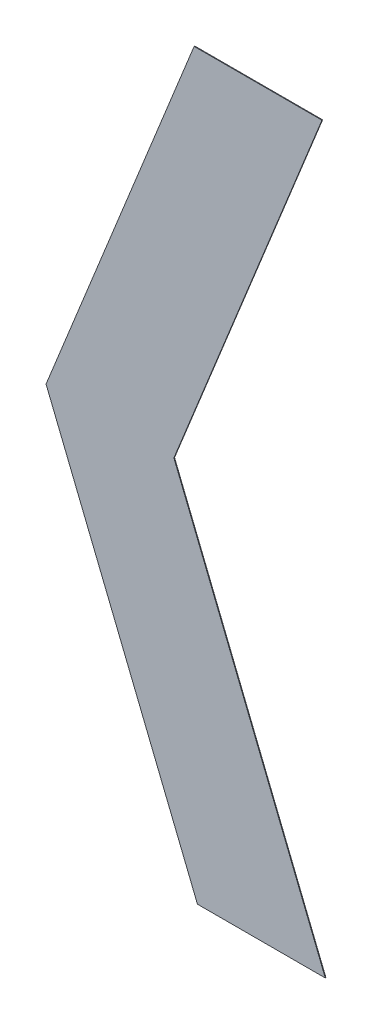
ISO-10303-21;
HEADER;
FILE_DESCRIPTION(('STEP AP214'),'2;1');
FILE_NAME('part.step','',(''),(''),'','','');
FILE_SCHEMA(('AUTOMOTIVE_DESIGN { 1 0 10303 214 1 1 1 1 }'));
ENDSEC;
DATA;
#1=APPLICATION_CONTEXT('core data for automotive mechanical design processes');
#2=APPLICATION_PROTOCOL_DEFINITION('international standard','automotive_design',2000,#1);
#3=PRODUCT_CONTEXT('',#1,'mechanical');
#4=PRODUCT('Part','Part','',(#3));
#5=PRODUCT_RELATED_PRODUCT_CATEGORY('part','',(#4));
#6=PRODUCT_DEFINITION_FORMATION('','',#4);
#7=PRODUCT_DEFINITION_CONTEXT('part definition',#1,'design');
#8=PRODUCT_DEFINITION('design','',#6,#7);
#9=PRODUCT_DEFINITION_SHAPE('','',#8);
#10=(LENGTH_UNIT() NAMED_UNIT(*) SI_UNIT(.MILLI.,.METRE.));
#11=(NAMED_UNIT(*) PLANE_ANGLE_UNIT() SI_UNIT($,.RADIAN.));
#12=(NAMED_UNIT(*) SI_UNIT($,.STERADIAN.) SOLID_ANGLE_UNIT());
#13=UNCERTAINTY_MEASURE_WITH_UNIT(LENGTH_MEASURE(1.E-05),#10,'distance_accuracy_value','');
#14=(GEOMETRIC_REPRESENTATION_CONTEXT(3) GLOBAL_UNCERTAINTY_ASSIGNED_CONTEXT((#13)) GLOBAL_UNIT_ASSIGNED_CONTEXT((#10,
#11,#12)) REPRESENTATION_CONTEXT('',''));
#15=CARTESIAN_POINT('',(0.,0.,0.));
#16=DIRECTION('',(0.,0.,1.));
#17=DIRECTION('',(1.,0.,0.));
#18=AXIS2_PLACEMENT_3D('',#15,#16,#17);
#19=CARTESIAN_POINT('',(0.6339191788637,-0.192580169588,0.0009));
#20=DIRECTION('',(0.,0.,-1.));
#21=DIRECTION('',(-1.,0.,0.));
#22=AXIS2_PLACEMENT_3D('',#19,#20,#21);
#23=PLANE('',#22);
#24=DIRECTION('',(-0.374606593416197,0.927183854566672,0.));
#25=VECTOR('',#24,1.);
#26=CARTESIAN_POINT('',(0.6357269529876,-0.192580169588,0.0009));
#27=LINE('',#26,#25);
#28=CARTESIAN_POINT('',(0.6357269529876,-0.192580169588,0.0009));
#29=VERTEX_POINT('',#28);
#30=CARTESIAN_POINT('',(0.6124914047398,-0.135070169588,0.0009));
#31=VERTEX_POINT('',#30);
#32=EDGE_CURVE('E11',#29,#31,#27,.T.);
#33=ORIENTED_EDGE('',*,*,#32,.T.);
#34=DIRECTION('',(0.374606593415521,0.927183854566945,0.));
#35=VECTOR('',#34,1.);
#36=CARTESIAN_POINT('',(0.6124914047398,-0.135070169588,0.0009));
#37=LINE('',#36,#35);
#38=CARTESIAN_POINT('',(0.635217879943,-0.078820169588,0.0009));
#39=VERTEX_POINT('',#38);
#40=EDGE_CURVE('E24',#31,#39,#37,.T.);
#41=ORIENTED_EDGE('',*,*,#40,.T.);
#42=DIRECTION('',(1.,0.,0.));
#43=VECTOR('',#42,1.);
#44=CARTESIAN_POINT('',(0.635217879943,-0.078820169588,0.0009));
#45=LINE('',#44,#43);
#46=CARTESIAN_POINT('',(0.654837879943,-0.078820169588,0.0009));
#47=VERTEX_POINT('',#46);
#48=EDGE_CURVE('E82',#39,#47,#45,.T.);
#49=ORIENTED_EDGE('',*,*,#48,.T.);
#50=DIRECTION('',(-0.374606593415527,-0.927183854566943,0.));
#51=VECTOR('',#50,1.);
#52=CARTESIAN_POINT('',(0.654837879943,-0.078820169588,0.0009));
#53=LINE('',#52,#51);
#54=CARTESIAN_POINT('',(0.6321114047398,-0.135070169588,0.0009));
#55=VERTEX_POINT('',#54);
#56=EDGE_CURVE('E112',#47,#55,#53,.T.);
#57=ORIENTED_EDGE('',*,*,#56,.T.);
#58=DIRECTION('',(0.374606593416192,-0.927183854566674,0.));
#59=VECTOR('',#58,1.);
#60=CARTESIAN_POINT('',(0.6321114047398,-0.135070169588,0.0009));
#61=LINE('',#60,#59);
#62=CARTESIAN_POINT('',(0.6553469529876,-0.192580169588,0.0009));
#63=VERTEX_POINT('',#62);
#64=EDGE_CURVE('E110',#55,#63,#61,.T.);
#65=ORIENTED_EDGE('',*,*,#64,.T.);
#66=DIRECTION('',(-1.,0.,0.));
#67=VECTOR('',#66,1.);
#68=CARTESIAN_POINT('',(0.6553469529876,-0.192580169588,0.0009));
#69=LINE('',#68,#67);
#70=EDGE_CURVE('E108',#63,#29,#69,.T.);
#71=ORIENTED_EDGE('',*,*,#70,.T.);
#72=EDGE_LOOP('',(#33,#41,#49,#57,#65,#71));
#73=FACE_BOUND('',#72,.T.);
#74=ADVANCED_FACE('F17',(#73),#23,.T.);
#75=CARTESIAN_POINT('',(0.6241091788637,-0.163825169588,0.0009));
#76=DIRECTION('',(-0.927183854566675,-0.374606593416191,0.));
#77=DIRECTION('',(0.,0.,1.));
#78=AXIS2_PLACEMENT_3D('',#75,#76,#77);
#79=PLANE('',#78);
#80=DIRECTION('',(0.374606593416191,-0.927183854566675,0.));
#81=VECTOR('',#80,1.);
#82=CARTESIAN_POINT('',(0.6124914047398,-0.135070169588,0.001));
#83=LINE('',#82,#81);
#84=CARTESIAN_POINT('',(0.6124914047398,-0.135070169588,0.001));
#85=VERTEX_POINT('',#84);
#86=CARTESIAN_POINT('',(0.6357269529876,-0.192580169588,0.001));
#87=VERTEX_POINT('',#86);
#88=EDGE_CURVE('E106',#85,#87,#83,.T.);
#89=ORIENTED_EDGE('',*,*,#88,.F.);
#90=DIRECTION('',(0.,0.,-1.));
#91=VECTOR('',#90,1.);
#92=CARTESIAN_POINT('',(0.6124914047398,-0.135070169588,0.001));
#93=LINE('',#92,#91);
#94=EDGE_CURVE('E87',#85,#31,#93,.T.);
#95=ORIENTED_EDGE('',*,*,#94,.T.);
#96=ORIENTED_EDGE('',*,*,#32,.F.);
#97=DIRECTION('',(0.,0.,-1.));
#98=VECTOR('',#97,1.);
#99=CARTESIAN_POINT('',(0.6357269529876,-0.192580169588,0.001));
#100=LINE('',#99,#98);
#101=EDGE_CURVE('E102',#87,#29,#100,.T.);
#102=ORIENTED_EDGE('',*,*,#101,.F.);
#103=EDGE_LOOP('',(#89,#95,#96,#102));
#104=FACE_BOUND('',#103,.T.);
#105=ADVANCED_FACE('F115',(#104),#79,.T.);
#106=CARTESIAN_POINT('',(0.6455369529876,-0.192580169588,0.0009));
#107=DIRECTION('',(0.,-1.,0.));
#108=DIRECTION('',(0.,0.,-1.));
#109=AXIS2_PLACEMENT_3D('',#106,#107,#108);
#110=PLANE('',#109);
#111=DIRECTION('',(1.,0.,0.));
#112=VECTOR('',#111,1.);
#113=CARTESIAN_POINT('',(0.6357269529876,-0.192580169588,0.001));
#114=LINE('',#113,#112);
#115=CARTESIAN_POINT('',(0.6553469529876,-0.192580169588,0.001));
#116=VERTEX_POINT('',#115);
#117=EDGE_CURVE('E100',#87,#116,#114,.T.);
#118=ORIENTED_EDGE('',*,*,#117,.F.);
#119=ORIENTED_EDGE('',*,*,#101,.T.);
#120=ORIENTED_EDGE('',*,*,#70,.F.);
#121=DIRECTION('',(0.,0.,-1.));
#122=VECTOR('',#121,1.);
#123=CARTESIAN_POINT('',(0.6553469529876,-0.192580169588,0.001));
#124=LINE('',#123,#122);
#125=EDGE_CURVE('E97',#116,#63,#124,.T.);
#126=ORIENTED_EDGE('',*,*,#125,.F.);
#127=EDGE_LOOP('',(#118,#119,#120,#126));
#128=FACE_BOUND('',#127,.T.);
#129=ADVANCED_FACE('F122',(#128),#110,.T.);
#130=CARTESIAN_POINT('',(0.6437291788637,-0.163825169588,0.0009));
#131=DIRECTION('',(0.927183854566677,0.374606593416186,0.));
#132=DIRECTION('',(0.,0.,-1.));
#133=AXIS2_PLACEMENT_3D('',#130,#131,#132);
#134=PLANE('',#133);
#135=DIRECTION('',(-0.374606593416186,0.927183854566677,0.));
#136=VECTOR('',#135,1.);
#137=CARTESIAN_POINT('',(0.6553469529876,-0.192580169588,0.001));
#138=LINE('',#137,#136);
#139=CARTESIAN_POINT('',(0.6321114047398,-0.135070169588,0.001));
#140=VERTEX_POINT('',#139);
#141=EDGE_CURVE('E95',#116,#140,#138,.T.);
#142=ORIENTED_EDGE('',*,*,#141,.F.);
#143=ORIENTED_EDGE('',*,*,#125,.T.);
#144=ORIENTED_EDGE('',*,*,#64,.F.);
#145=DIRECTION('',(0.,0.,-1.));
#146=VECTOR('',#145,1.);
#147=CARTESIAN_POINT('',(0.6321114047398,-0.135070169588,0.001));
#148=LINE('',#147,#146);
#149=EDGE_CURVE('E92',#140,#55,#148,.T.);
#150=ORIENTED_EDGE('',*,*,#149,.F.);
#151=EDGE_LOOP('',(#142,#143,#144,#150));
#152=FACE_BOUND('',#151,.T.);
#153=ADVANCED_FACE('F125',(#152),#134,.T.);
#154=CARTESIAN_POINT('',(0.6434746423414,-0.106945169588,0.0009));
#155=DIRECTION('',(0.927183854566945,-0.374606593415521,0.));
#156=DIRECTION('',(0.,0.,-1.));
#157=AXIS2_PLACEMENT_3D('',#154,#155,#156);
#158=PLANE('',#157);
#159=DIRECTION('',(0.374606593415521,0.927183854566945,0.));
#160=VECTOR('',#159,1.);
#161=CARTESIAN_POINT('',(0.6321114047398,-0.135070169588,0.001));
#162=LINE('',#161,#160);
#163=CARTESIAN_POINT('',(0.654837879943,-0.078820169588,0.001));
#164=VERTEX_POINT('',#163);
#165=EDGE_CURVE('E72',#140,#164,#162,.T.);
#166=ORIENTED_EDGE('',*,*,#165,.F.);
#167=ORIENTED_EDGE('',*,*,#149,.T.);
#168=ORIENTED_EDGE('',*,*,#56,.F.);
#169=DIRECTION('',(0.,0.,-1.));
#170=VECTOR('',#169,1.);
#171=CARTESIAN_POINT('',(0.654837879943,-0.078820169588,0.001));
#172=LINE('',#171,#170);
#173=EDGE_CURVE('E76',#164,#47,#172,.T.);
#174=ORIENTED_EDGE('',*,*,#173,.F.);
#175=EDGE_LOOP('',(#166,#167,#168,#174));
#176=FACE_BOUND('',#175,.T.);
#177=ADVANCED_FACE('F127',(#176),#158,.T.);
#178=CARTESIAN_POINT('',(0.645027879943,-0.078820169588,0.0009));
#179=DIRECTION('',(0.,1.,0.));
#180=DIRECTION('',(0.,0.,1.));
#181=AXIS2_PLACEMENT_3D('',#178,#179,#180);
#182=PLANE('',#181);
#183=DIRECTION('',(-1.,0.,0.));
#184=VECTOR('',#183,1.);
#185=CARTESIAN_POINT('',(0.654837879943,-0.078820169588,0.001));
#186=LINE('',#185,#184);
#187=CARTESIAN_POINT('',(0.635217879943,-0.078820169588,0.001));
#188=VERTEX_POINT('',#187);
#189=EDGE_CURVE('E66',#164,#188,#186,.T.);
#190=ORIENTED_EDGE('',*,*,#189,.F.);
#191=ORIENTED_EDGE('',*,*,#173,.T.);
#192=ORIENTED_EDGE('',*,*,#48,.F.);
#193=DIRECTION('',(0.,0.,-1.));
#194=VECTOR('',#193,1.);
#195=CARTESIAN_POINT('',(0.635217879943,-0.078820169588,0.001));
#196=LINE('',#195,#194);
#197=EDGE_CURVE('E77',#188,#39,#196,.T.);
#198=ORIENTED_EDGE('',*,*,#197,.F.);
#199=EDGE_LOOP('',(#190,#191,#192,#198));
#200=FACE_BOUND('',#199,.T.);
#201=ADVANCED_FACE('F81',(#200),#182,.T.);
#202=CARTESIAN_POINT('',(0.6238546423414,-0.106945169588001,0.0009));
#203=DIRECTION('',(-0.927183854566948,0.374606593415515,0.));
#204=DIRECTION('',(0.,0.,1.));
#205=AXIS2_PLACEMENT_3D('',#202,#203,#204);
#206=PLANE('',#205);
#207=DIRECTION('',(-0.374606593415516,-0.927183854566948,0.));
#208=VECTOR('',#207,1.);
#209=CARTESIAN_POINT('',(0.635217879943,-0.078820169588,0.001));
#210=LINE('',#209,#208);
#211=EDGE_CURVE('E70',#188,#85,#210,.T.);
#212=ORIENTED_EDGE('',*,*,#211,.F.);
#213=ORIENTED_EDGE('',*,*,#197,.T.);
#214=ORIENTED_EDGE('',*,*,#40,.F.);
#215=ORIENTED_EDGE('',*,*,#94,.F.);
#216=EDGE_LOOP('',(#212,#213,#214,#215));
#217=FACE_BOUND('',#216,.T.);
#218=ADVANCED_FACE('F86',(#217),#206,.T.);
#219=CARTESIAN_POINT('',(0.6339191788637,-0.192580169588,0.001));
#220=DIRECTION('',(0.,0.,-1.));
#221=DIRECTION('',(-1.,0.,0.));
#222=AXIS2_PLACEMENT_3D('',#219,#220,#221);
#223=PLANE('',#222);
#224=ORIENTED_EDGE('',*,*,#189,.T.);
#225=ORIENTED_EDGE('',*,*,#211,.T.);
#226=ORIENTED_EDGE('',*,*,#88,.T.);
#227=ORIENTED_EDGE('',*,*,#117,.T.);
#228=ORIENTED_EDGE('',*,*,#141,.T.);
#229=ORIENTED_EDGE('',*,*,#165,.T.);
#230=EDGE_LOOP('',(#224,#225,#226,#227,#228,#229));
#231=FACE_BOUND('',#230,.T.);
#232=ADVANCED_FACE('F68',(#231),#223,.F.);
#233=CLOSED_SHELL('',(#74,#105,#129,#153,#177,#201,#218,#232));
#234=MANIFOLD_SOLID_BREP('B1',#233);
#235=ADVANCED_BREP_SHAPE_REPRESENTATION('',(#18,#234),#14);
#236=SHAPE_DEFINITION_REPRESENTATION(#9,#235);
ENDSEC;
END-ISO-10303-21;
